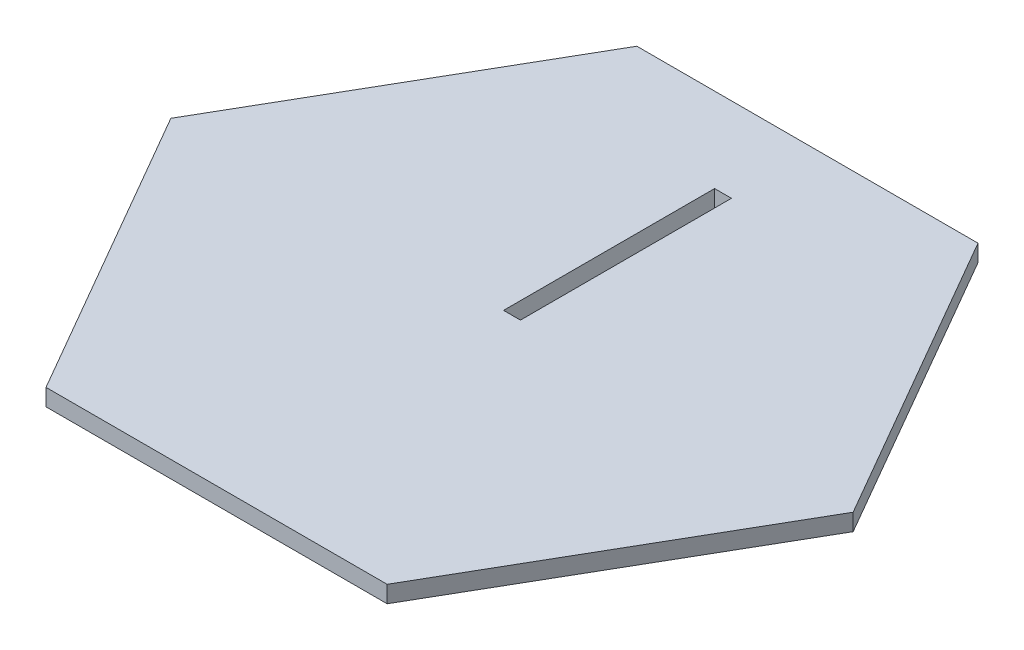
ISO-10303-21;
HEADER;
FILE_DESCRIPTION(('STEP AP214'),'2;1');
FILE_NAME('part.step','',(''),(''),'','','');
FILE_SCHEMA(('AUTOMOTIVE_DESIGN { 1 0 10303 214 1 1 1 1 }'));
ENDSEC;
DATA;
#1=APPLICATION_CONTEXT('core data for automotive mechanical design processes');
#2=APPLICATION_PROTOCOL_DEFINITION('international standard','automotive_design',2000,#1);
#3=PRODUCT_CONTEXT('',#1,'mechanical');
#4=PRODUCT('Part','Part','',(#3));
#5=PRODUCT_RELATED_PRODUCT_CATEGORY('part','',(#4));
#6=PRODUCT_DEFINITION_FORMATION('','',#4);
#7=PRODUCT_DEFINITION_CONTEXT('part definition',#1,'design');
#8=PRODUCT_DEFINITION('design','',#6,#7);
#9=PRODUCT_DEFINITION_SHAPE('','',#8);
#10=(LENGTH_UNIT() NAMED_UNIT(*) SI_UNIT(.MILLI.,.METRE.));
#11=(NAMED_UNIT(*) PLANE_ANGLE_UNIT() SI_UNIT($,.RADIAN.));
#12=(NAMED_UNIT(*) SI_UNIT($,.STERADIAN.) SOLID_ANGLE_UNIT());
#13=UNCERTAINTY_MEASURE_WITH_UNIT(LENGTH_MEASURE(1.E-05),#10,'distance_accuracy_value','');
#14=(GEOMETRIC_REPRESENTATION_CONTEXT(3) GLOBAL_UNCERTAINTY_ASSIGNED_CONTEXT((#13)) GLOBAL_UNIT_ASSIGNED_CONTEXT((#10,
#11,#12)) REPRESENTATION_CONTEXT('',''));
#15=CARTESIAN_POINT('',(0.,0.,0.));
#16=DIRECTION('',(0.,0.,1.));
#17=DIRECTION('',(1.,0.,0.));
#18=AXIS2_PLACEMENT_3D('',#15,#16,#17);
#19=CARTESIAN_POINT('',(-40.4145188432738,2.,0.));
#20=DIRECTION('',(0.866025403784439,0.,-0.5));
#21=DIRECTION('',(-0.5,0.,-0.866025403784439));
#22=AXIS2_PLACEMENT_3D('',#19,#20,#21);
#23=PLANE('',#22);
#24=DIRECTION('',(0.5,0.,0.866025403784439));
#25=VECTOR('',#24,1.);
#26=CARTESIAN_POINT('',(-40.4145188432738,0.,0.));
#27=LINE('',#26,#25);
#28=CARTESIAN_POINT('',(-40.4145188432738,0.,0.));
#29=VERTEX_POINT('',#28);
#30=CARTESIAN_POINT('',(-20.2072594216369,0.,35.));
#31=VERTEX_POINT('',#30);
#32=EDGE_CURVE('E147',#29,#31,#27,.T.);
#33=ORIENTED_EDGE('',*,*,#32,.T.);
#34=DIRECTION('',(0.,-1.,0.));
#35=VECTOR('',#34,1.);
#36=CARTESIAN_POINT('',(-20.2072594216369,2.,35.));
#37=LINE('',#36,#35);
#38=CARTESIAN_POINT('',(-20.2072594216369,2.,35.));
#39=VERTEX_POINT('',#38);
#40=EDGE_CURVE('E11',#39,#31,#37,.T.);
#41=ORIENTED_EDGE('',*,*,#40,.F.);
#42=DIRECTION('',(0.5,0.,0.866025403784439));
#43=VECTOR('',#42,1.);
#44=CARTESIAN_POINT('',(-40.4145188432738,2.,0.));
#45=LINE('',#44,#43);
#46=CARTESIAN_POINT('',(-40.4145188432738,2.,0.));
#47=VERTEX_POINT('',#46);
#48=EDGE_CURVE('E148',#47,#39,#45,.T.);
#49=ORIENTED_EDGE('',*,*,#48,.F.);
#50=DIRECTION('',(0.,-1.,0.));
#51=VECTOR('',#50,1.);
#52=CARTESIAN_POINT('',(-40.4145188432738,2.,0.));
#53=LINE('',#52,#51);
#54=EDGE_CURVE('E162',#47,#29,#53,.T.);
#55=ORIENTED_EDGE('',*,*,#54,.T.);
#56=EDGE_LOOP('',(#33,#41,#49,#55));
#57=FACE_BOUND('',#56,.T.);
#58=ADVANCED_FACE('F35',(#57),#23,.F.);
#59=CARTESIAN_POINT('',(-20.2072594216369,2.,35.));
#60=DIRECTION('',(0.,0.,-1.));
#61=DIRECTION('',(-1.,0.,0.));
#62=AXIS2_PLACEMENT_3D('',#59,#60,#61);
#63=PLANE('',#62);
#64=DIRECTION('',(1.,0.,0.));
#65=VECTOR('',#64,1.);
#66=CARTESIAN_POINT('',(-20.2072594216369,0.,35.));
#67=LINE('',#66,#65);
#68=CARTESIAN_POINT('',(20.2072594216369,0.,35.));
#69=VERTEX_POINT('',#68);
#70=EDGE_CURVE('E165',#31,#69,#67,.T.);
#71=ORIENTED_EDGE('',*,*,#70,.T.);
#72=DIRECTION('',(0.,-1.,0.));
#73=VECTOR('',#72,1.);
#74=CARTESIAN_POINT('',(20.2072594216369,2.,35.));
#75=LINE('',#74,#73);
#76=CARTESIAN_POINT('',(20.2072594216369,2.,35.));
#77=VERTEX_POINT('',#76);
#78=EDGE_CURVE('E42',#77,#69,#75,.T.);
#79=ORIENTED_EDGE('',*,*,#78,.F.);
#80=DIRECTION('',(1.,0.,0.));
#81=VECTOR('',#80,1.);
#82=CARTESIAN_POINT('',(-20.2072594216369,2.,35.));
#83=LINE('',#82,#81);
#84=EDGE_CURVE('E151',#39,#77,#83,.T.);
#85=ORIENTED_EDGE('',*,*,#84,.F.);
#86=ORIENTED_EDGE('',*,*,#40,.T.);
#87=EDGE_LOOP('',(#71,#79,#85,#86));
#88=FACE_BOUND('',#87,.T.);
#89=ADVANCED_FACE('F210',(#88),#63,.F.);
#90=CARTESIAN_POINT('',(20.2072594216369,2.,35.));
#91=DIRECTION('',(-0.866025403784439,0.,-0.5));
#92=DIRECTION('',(-0.5,0.,0.866025403784439));
#93=AXIS2_PLACEMENT_3D('',#90,#91,#92);
#94=PLANE('',#93);
#95=DIRECTION('',(0.5,0.,-0.866025403784439));
#96=VECTOR('',#95,1.);
#97=CARTESIAN_POINT('',(20.2072594216369,0.,35.));
#98=LINE('',#97,#96);
#99=CARTESIAN_POINT('',(40.4145188432738,0.,0.));
#100=VERTEX_POINT('',#99);
#101=EDGE_CURVE('E167',#69,#100,#98,.T.);
#102=ORIENTED_EDGE('',*,*,#101,.T.);
#103=DIRECTION('',(0.,-1.,0.));
#104=VECTOR('',#103,1.);
#105=CARTESIAN_POINT('',(40.4145188432738,2.,0.));
#106=LINE('',#105,#104);
#107=CARTESIAN_POINT('',(40.4145188432738,2.,0.));
#108=VERTEX_POINT('',#107);
#109=EDGE_CURVE('E182',#108,#100,#106,.T.);
#110=ORIENTED_EDGE('',*,*,#109,.F.);
#111=DIRECTION('',(0.5,0.,-0.866025403784439));
#112=VECTOR('',#111,1.);
#113=CARTESIAN_POINT('',(20.2072594216369,2.,35.));
#114=LINE('',#113,#112);
#115=EDGE_CURVE('E154',#77,#108,#114,.T.);
#116=ORIENTED_EDGE('',*,*,#115,.F.);
#117=ORIENTED_EDGE('',*,*,#78,.T.);
#118=EDGE_LOOP('',(#102,#110,#116,#117));
#119=FACE_BOUND('',#118,.T.);
#120=ADVANCED_FACE('F189',(#119),#94,.F.);
#121=CARTESIAN_POINT('',(40.4145188432738,2.,0.));
#122=DIRECTION('',(-0.866025403784438,0.,0.5));
#123=DIRECTION('',(0.5,0.,0.866025403784438));
#124=AXIS2_PLACEMENT_3D('',#121,#122,#123);
#125=PLANE('',#124);
#126=DIRECTION('',(-0.5,0.,-0.866025403784438));
#127=VECTOR('',#126,1.);
#128=CARTESIAN_POINT('',(40.4145188432738,0.,0.));
#129=LINE('',#128,#127);
#130=CARTESIAN_POINT('',(20.2072594216369,0.,-35.));
#131=VERTEX_POINT('',#130);
#132=EDGE_CURVE('E169',#100,#131,#129,.T.);
#133=ORIENTED_EDGE('',*,*,#132,.T.);
#134=DIRECTION('',(0.,-1.,0.));
#135=VECTOR('',#134,1.);
#136=CARTESIAN_POINT('',(20.2072594216369,2.,-35.));
#137=LINE('',#136,#135);
#138=CARTESIAN_POINT('',(20.2072594216369,2.,-35.));
#139=VERTEX_POINT('',#138);
#140=EDGE_CURVE('E179',#139,#131,#137,.T.);
#141=ORIENTED_EDGE('',*,*,#140,.F.);
#142=DIRECTION('',(-0.5,0.,-0.866025403784438));
#143=VECTOR('',#142,1.);
#144=CARTESIAN_POINT('',(40.4145188432738,2.,0.));
#145=LINE('',#144,#143);
#146=EDGE_CURVE('E156',#108,#139,#145,.T.);
#147=ORIENTED_EDGE('',*,*,#146,.F.);
#148=ORIENTED_EDGE('',*,*,#109,.T.);
#149=EDGE_LOOP('',(#133,#141,#147,#148));
#150=FACE_BOUND('',#149,.T.);
#151=ADVANCED_FACE('F198',(#150),#125,.F.);
#152=CARTESIAN_POINT('',(20.2072594216369,2.,-35.));
#153=DIRECTION('',(0.,0.,1.));
#154=DIRECTION('',(1.,0.,0.));
#155=AXIS2_PLACEMENT_3D('',#152,#153,#154);
#156=PLANE('',#155);
#157=DIRECTION('',(-1.,0.,0.));
#158=VECTOR('',#157,1.);
#159=CARTESIAN_POINT('',(20.2072594216369,0.,-35.));
#160=LINE('',#159,#158);
#161=CARTESIAN_POINT('',(-20.2072594216369,0.,-35.));
#162=VERTEX_POINT('',#161);
#163=EDGE_CURVE('E171',#131,#162,#160,.T.);
#164=ORIENTED_EDGE('',*,*,#163,.T.);
#165=DIRECTION('',(0.,-1.,0.));
#166=VECTOR('',#165,1.);
#167=CARTESIAN_POINT('',(-20.2072594216369,2.,-35.));
#168=LINE('',#167,#166);
#169=CARTESIAN_POINT('',(-20.2072594216369,2.,-35.));
#170=VERTEX_POINT('',#169);
#171=EDGE_CURVE('E176',#170,#162,#168,.T.);
#172=ORIENTED_EDGE('',*,*,#171,.F.);
#173=DIRECTION('',(-1.,0.,0.));
#174=VECTOR('',#173,1.);
#175=CARTESIAN_POINT('',(20.2072594216369,2.,-35.));
#176=LINE('',#175,#174);
#177=EDGE_CURVE('E158',#139,#170,#176,.T.);
#178=ORIENTED_EDGE('',*,*,#177,.F.);
#179=ORIENTED_EDGE('',*,*,#140,.T.);
#180=EDGE_LOOP('',(#164,#172,#178,#179));
#181=FACE_BOUND('',#180,.T.);
#182=ADVANCED_FACE('F202',(#181),#156,.F.);
#183=CARTESIAN_POINT('',(-20.2072594216369,2.,-35.));
#184=DIRECTION('',(0.866025403784439,0.,0.5));
#185=DIRECTION('',(0.5,0.,-0.866025403784439));
#186=AXIS2_PLACEMENT_3D('',#183,#184,#185);
#187=PLANE('',#186);
#188=DIRECTION('',(-0.5,0.,0.866025403784439));
#189=VECTOR('',#188,1.);
#190=CARTESIAN_POINT('',(-20.2072594216369,0.,-35.));
#191=LINE('',#190,#189);
#192=EDGE_CURVE('E152',#162,#29,#191,.T.);
#193=ORIENTED_EDGE('',*,*,#192,.T.);
#194=ORIENTED_EDGE('',*,*,#54,.F.);
#195=DIRECTION('',(-0.5,0.,0.866025403784439));
#196=VECTOR('',#195,1.);
#197=CARTESIAN_POINT('',(-20.2072594216369,2.,-35.));
#198=LINE('',#197,#196);
#199=EDGE_CURVE('E160',#170,#47,#198,.T.);
#200=ORIENTED_EDGE('',*,*,#199,.F.);
#201=ORIENTED_EDGE('',*,*,#171,.T.);
#202=EDGE_LOOP('',(#193,#194,#200,#201));
#203=FACE_BOUND('',#202,.T.);
#204=ADVANCED_FACE('F213',(#203),#187,.F.);
#205=CARTESIAN_POINT('',(0.,2.,0.));
#206=DIRECTION('',(0.,1.,0.));
#207=DIRECTION('',(0.,0.,1.));
#208=AXIS2_PLACEMENT_3D('',#205,#206,#207);
#209=PLANE('',#208);
#210=DIRECTION('',(0.,0.,-1.));
#211=VECTOR('',#210,1.);
#212=CARTESIAN_POINT('',(1.,2.,0.));
#213=LINE('',#212,#211);
#214=CARTESIAN_POINT('',(1.,2.,0.));
#215=VERTEX_POINT('',#214);
#216=CARTESIAN_POINT('',(1.,2.,-25.));
#217=VERTEX_POINT('',#216);
#218=EDGE_CURVE('E122',#215,#217,#213,.T.);
#219=ORIENTED_EDGE('',*,*,#218,.F.);
#220=DIRECTION('',(-1.,0.,0.));
#221=VECTOR('',#220,1.);
#222=CARTESIAN_POINT('',(0.,2.,0.));
#223=LINE('',#222,#221);
#224=CARTESIAN_POINT('',(-1.,2.,0.));
#225=VERTEX_POINT('',#224);
#226=EDGE_CURVE('E143',#215,#225,#223,.T.);
#227=ORIENTED_EDGE('',*,*,#226,.T.);
#228=DIRECTION('',(0.,0.,-1.));
#229=VECTOR('',#228,1.);
#230=CARTESIAN_POINT('',(-1.,2.,0.));
#231=LINE('',#230,#229);
#232=CARTESIAN_POINT('',(-1.,2.,-25.));
#233=VERTEX_POINT('',#232);
#234=EDGE_CURVE('E140',#225,#233,#231,.T.);
#235=ORIENTED_EDGE('',*,*,#234,.T.);
#236=DIRECTION('',(1.,0.,0.));
#237=VECTOR('',#236,1.);
#238=CARTESIAN_POINT('',(0.,2.,-25.));
#239=LINE('',#238,#237);
#240=EDGE_CURVE('E134',#233,#217,#239,.T.);
#241=ORIENTED_EDGE('',*,*,#240,.T.);
#242=EDGE_LOOP('',(#219,#227,#235,#241));
#243=FACE_BOUND('',#242,.T.);
#244=ORIENTED_EDGE('',*,*,#48,.T.);
#245=ORIENTED_EDGE('',*,*,#84,.T.);
#246=ORIENTED_EDGE('',*,*,#115,.T.);
#247=ORIENTED_EDGE('',*,*,#146,.T.);
#248=ORIENTED_EDGE('',*,*,#177,.T.);
#249=ORIENTED_EDGE('',*,*,#199,.T.);
#250=EDGE_LOOP('',(#244,#245,#246,#247,#248,#249));
#251=FACE_BOUND('',#250,.T.);
#252=ADVANCED_FACE('F206',(#243,#251),#209,.T.);
#253=CARTESIAN_POINT('',(0.,0.,0.));
#254=DIRECTION('',(0.,1.,0.));
#255=DIRECTION('',(0.,0.,1.));
#256=AXIS2_PLACEMENT_3D('',#253,#254,#255);
#257=PLANE('',#256);
#258=DIRECTION('',(-1.,0.,0.));
#259=VECTOR('',#258,1.);
#260=CARTESIAN_POINT('',(1.,0.,0.));
#261=LINE('',#260,#259);
#262=CARTESIAN_POINT('',(1.,0.,0.));
#263=VERTEX_POINT('',#262);
#264=CARTESIAN_POINT('',(-1.,0.,0.));
#265=VERTEX_POINT('',#264);
#266=EDGE_CURVE('E124',#263,#265,#261,.T.);
#267=ORIENTED_EDGE('',*,*,#266,.F.);
#268=DIRECTION('',(0.,0.,-1.));
#269=VECTOR('',#268,1.);
#270=CARTESIAN_POINT('',(1.,0.,0.));
#271=LINE('',#270,#269);
#272=CARTESIAN_POINT('',(1.,0.,-25.));
#273=VERTEX_POINT('',#272);
#274=EDGE_CURVE('E114',#263,#273,#271,.T.);
#275=ORIENTED_EDGE('',*,*,#274,.T.);
#276=DIRECTION('',(1.,0.,0.));
#277=VECTOR('',#276,1.);
#278=CARTESIAN_POINT('',(-1.,0.,-25.));
#279=LINE('',#278,#277);
#280=CARTESIAN_POINT('',(-1.,0.,-25.));
#281=VERTEX_POINT('',#280);
#282=EDGE_CURVE('E108',#281,#273,#279,.T.);
#283=ORIENTED_EDGE('',*,*,#282,.F.);
#284=DIRECTION('',(0.,0.,-1.));
#285=VECTOR('',#284,1.);
#286=CARTESIAN_POINT('',(-1.,0.,0.));
#287=LINE('',#286,#285);
#288=EDGE_CURVE('E113',#265,#281,#287,.T.);
#289=ORIENTED_EDGE('',*,*,#288,.F.);
#290=EDGE_LOOP('',(#267,#275,#283,#289));
#291=FACE_BOUND('',#290,.T.);
#292=ORIENTED_EDGE('',*,*,#32,.F.);
#293=ORIENTED_EDGE('',*,*,#192,.F.);
#294=ORIENTED_EDGE('',*,*,#163,.F.);
#295=ORIENTED_EDGE('',*,*,#132,.F.);
#296=ORIENTED_EDGE('',*,*,#101,.F.);
#297=ORIENTED_EDGE('',*,*,#70,.F.);
#298=EDGE_LOOP('',(#292,#293,#294,#295,#296,#297));
#299=FACE_BOUND('',#298,.T.);
#300=ADVANCED_FACE('F126',(#291,#299),#257,.F.);
#301=CARTESIAN_POINT('',(1.,0.,0.));
#302=DIRECTION('',(1.,0.,0.));
#303=DIRECTION('',(0.,0.,-1.));
#304=AXIS2_PLACEMENT_3D('',#301,#302,#303);
#305=PLANE('',#304);
#306=ORIENTED_EDGE('',*,*,#218,.T.);
#307=DIRECTION('',(0.,1.,0.));
#308=VECTOR('',#307,1.);
#309=CARTESIAN_POINT('',(1.,0.,-25.));
#310=LINE('',#309,#308);
#311=EDGE_CURVE('E49',#273,#217,#310,.T.);
#312=ORIENTED_EDGE('',*,*,#311,.F.);
#313=ORIENTED_EDGE('',*,*,#274,.F.);
#314=DIRECTION('',(0.,1.,0.));
#315=VECTOR('',#314,1.);
#316=CARTESIAN_POINT('',(1.,0.,0.));
#317=LINE('',#316,#315);
#318=EDGE_CURVE('E132',#263,#215,#317,.T.);
#319=ORIENTED_EDGE('',*,*,#318,.T.);
#320=EDGE_LOOP('',(#306,#312,#313,#319));
#321=FACE_BOUND('',#320,.T.);
#322=ADVANCED_FACE('F118',(#321),#305,.F.);
#323=CARTESIAN_POINT('',(1.,0.,0.));
#324=DIRECTION('',(0.,0.,-1.));
#325=DIRECTION('',(-1.,0.,0.));
#326=AXIS2_PLACEMENT_3D('',#323,#324,#325);
#327=PLANE('',#326);
#328=ORIENTED_EDGE('',*,*,#318,.F.);
#329=ORIENTED_EDGE('',*,*,#266,.T.);
#330=DIRECTION('',(0.,1.,0.));
#331=VECTOR('',#330,1.);
#332=CARTESIAN_POINT('',(-1.,0.,0.));
#333=LINE('',#332,#331);
#334=EDGE_CURVE('E135',#265,#225,#333,.T.);
#335=ORIENTED_EDGE('',*,*,#334,.T.);
#336=ORIENTED_EDGE('',*,*,#226,.F.);
#337=EDGE_LOOP('',(#328,#329,#335,#336));
#338=FACE_BOUND('',#337,.T.);
#339=ADVANCED_FACE('F264',(#338),#327,.T.);
#340=CARTESIAN_POINT('',(-1.,0.,0.));
#341=DIRECTION('',(1.,0.,0.));
#342=DIRECTION('',(0.,0.,-1.));
#343=AXIS2_PLACEMENT_3D('',#340,#341,#342);
#344=PLANE('',#343);
#345=ORIENTED_EDGE('',*,*,#334,.F.);
#346=ORIENTED_EDGE('',*,*,#288,.T.);
#347=DIRECTION('',(0.,1.,0.));
#348=VECTOR('',#347,1.);
#349=CARTESIAN_POINT('',(-1.,0.,-25.));
#350=LINE('',#349,#348);
#351=EDGE_CURVE('E54',#281,#233,#350,.T.);
#352=ORIENTED_EDGE('',*,*,#351,.T.);
#353=ORIENTED_EDGE('',*,*,#234,.F.);
#354=EDGE_LOOP('',(#345,#346,#352,#353));
#355=FACE_BOUND('',#354,.T.);
#356=ADVANCED_FACE('F273',(#355),#344,.T.);
#357=CARTESIAN_POINT('',(-1.,0.,-25.));
#358=DIRECTION('',(0.,0.,1.));
#359=DIRECTION('',(1.,0.,0.));
#360=AXIS2_PLACEMENT_3D('',#357,#358,#359);
#361=PLANE('',#360);
#362=ORIENTED_EDGE('',*,*,#351,.F.);
#363=ORIENTED_EDGE('',*,*,#282,.T.);
#364=ORIENTED_EDGE('',*,*,#311,.T.);
#365=ORIENTED_EDGE('',*,*,#240,.F.);
#366=EDGE_LOOP('',(#362,#363,#364,#365));
#367=FACE_BOUND('',#366,.T.);
#368=ADVANCED_FACE('F109',(#367),#361,.T.);
#369=CLOSED_SHELL('',(#58,#89,#120,#151,#182,#204,#252,#300,#322,#339,#356,#368));
#370=MANIFOLD_SOLID_BREP('B2',#369);
#371=ADVANCED_BREP_SHAPE_REPRESENTATION('',(#18,#370),#14);
#372=SHAPE_DEFINITION_REPRESENTATION(#9,#371);
ENDSEC;
END-ISO-10303-21;
